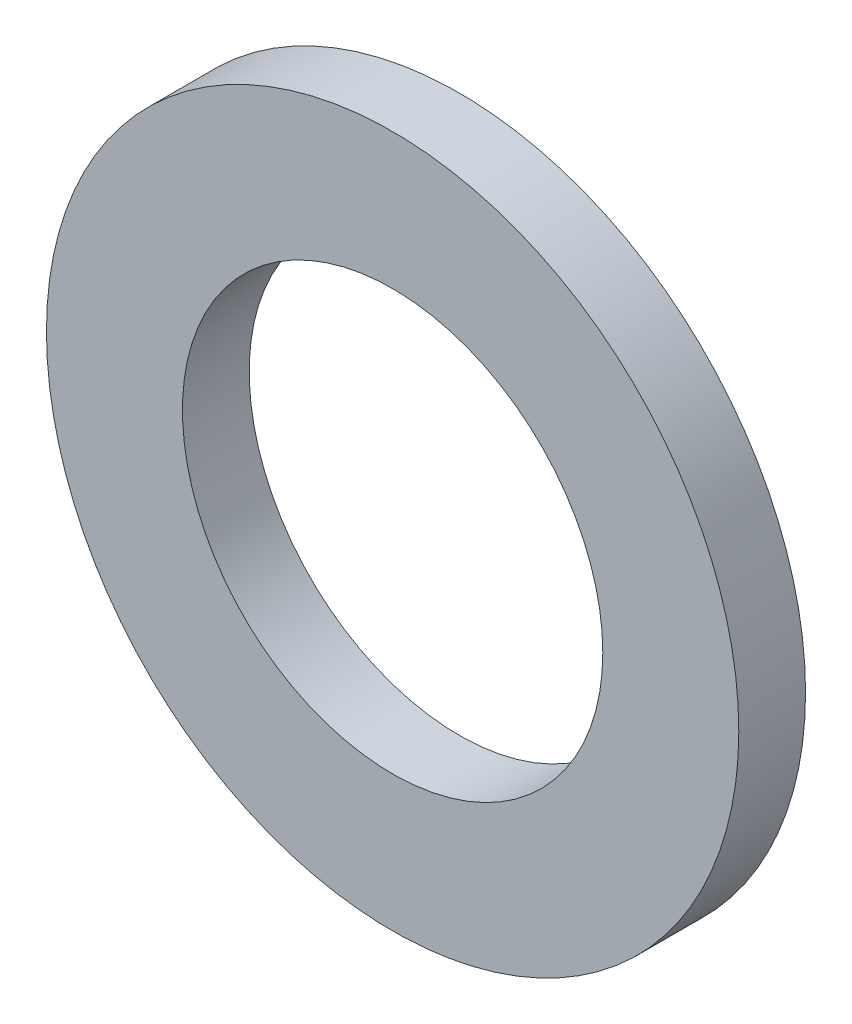
ISO-10303-21;
HEADER;
FILE_DESCRIPTION(('STEP AP214'),'2;1');
FILE_NAME('part.step','',(''),(''),'','','');
FILE_SCHEMA(('AUTOMOTIVE_DESIGN { 1 0 10303 214 1 1 1 1 }'));
ENDSEC;
DATA;
#1=APPLICATION_CONTEXT('core data for automotive mechanical design processes');
#2=APPLICATION_PROTOCOL_DEFINITION('international standard','automotive_design',2000,#1);
#3=PRODUCT_CONTEXT('',#1,'mechanical');
#4=PRODUCT('Part','Part','',(#3));
#5=PRODUCT_RELATED_PRODUCT_CATEGORY('part','',(#4));
#6=PRODUCT_DEFINITION_FORMATION('','',#4);
#7=PRODUCT_DEFINITION_CONTEXT('part definition',#1,'design');
#8=PRODUCT_DEFINITION('design','',#6,#7);
#9=PRODUCT_DEFINITION_SHAPE('','',#8);
#10=(LENGTH_UNIT() NAMED_UNIT(*) SI_UNIT(.MILLI.,.METRE.));
#11=(NAMED_UNIT(*) PLANE_ANGLE_UNIT() SI_UNIT($,.RADIAN.));
#12=(NAMED_UNIT(*) SI_UNIT($,.STERADIAN.) SOLID_ANGLE_UNIT());
#13=UNCERTAINTY_MEASURE_WITH_UNIT(LENGTH_MEASURE(1.E-05),#10,'distance_accuracy_value','');
#14=(GEOMETRIC_REPRESENTATION_CONTEXT(3) GLOBAL_UNCERTAINTY_ASSIGNED_CONTEXT((#13)) GLOBAL_UNIT_ASSIGNED_CONTEXT((#10,
#11,#12)) REPRESENTATION_CONTEXT('',''));
#15=CARTESIAN_POINT('',(0.,0.,0.));
#16=DIRECTION('',(0.,0.,1.));
#17=DIRECTION('',(1.,0.,0.));
#18=AXIS2_PLACEMENT_3D('',#15,#16,#17);
#19=CARTESIAN_POINT('',(0.,0.,2.7));
#20=DIRECTION('',(0.,0.,1.));
#21=DIRECTION('',(1.,0.,0.));
#22=AXIS2_PLACEMENT_3D('',#19,#20,#21);
#23=PLANE('',#22);
#24=CARTESIAN_POINT('',(0.,0.,2.7));
#25=DIRECTION('',(0.,0.,1.));
#26=DIRECTION('',(1.,0.,0.));
#27=AXIS2_PLACEMENT_3D('',#24,#25,#26);
#28=CIRCLE('',#27,14.);
#29=CARTESIAN_POINT('',(14.,0.,2.7));
#30=VERTEX_POINT('',#29);
#31=EDGE_CURVE('E10',#30,#30,#28,.T.);
#32=ORIENTED_EDGE('',*,*,#31,.T.);
#33=EDGE_LOOP('',(#32));
#34=FACE_BOUND('',#33,.T.);
#35=CARTESIAN_POINT('',(0.,0.,2.7));
#36=DIRECTION('',(0.,0.,1.));
#37=DIRECTION('',(1.,0.,0.));
#38=AXIS2_PLACEMENT_3D('',#35,#36,#37);
#39=CIRCLE('',#38,8.5);
#40=CARTESIAN_POINT('',(8.5,0.,2.7));
#41=VERTEX_POINT('',#40);
#42=EDGE_CURVE('E39',#41,#41,#39,.T.);
#43=ORIENTED_EDGE('',*,*,#42,.F.);
#44=EDGE_LOOP('',(#43));
#45=FACE_BOUND('',#44,.T.);
#46=ADVANCED_FACE('F28',(#34,#45),#23,.T.);
#47=CARTESIAN_POINT('',(0.,0.,0.));
#48=DIRECTION('',(0.,0.,1.));
#49=DIRECTION('',(1.,0.,0.));
#50=AXIS2_PLACEMENT_3D('',#47,#48,#49);
#51=PLANE('',#50);
#52=CARTESIAN_POINT('',(0.,0.,0.));
#53=DIRECTION('',(0.,0.,1.));
#54=DIRECTION('',(1.,0.,0.));
#55=AXIS2_PLACEMENT_3D('',#52,#53,#54);
#56=CIRCLE('',#55,14.);
#57=CARTESIAN_POINT('',(14.,0.,0.));
#58=VERTEX_POINT('',#57);
#59=EDGE_CURVE('E32',#58,#58,#56,.T.);
#60=ORIENTED_EDGE('',*,*,#59,.F.);
#61=EDGE_LOOP('',(#60));
#62=FACE_BOUND('',#61,.T.);
#63=CARTESIAN_POINT('',(0.,0.,0.));
#64=DIRECTION('',(0.,0.,1.));
#65=DIRECTION('',(1.,0.,0.));
#66=AXIS2_PLACEMENT_3D('',#63,#64,#65);
#67=CIRCLE('',#66,8.5);
#68=CARTESIAN_POINT('',(8.5,0.,0.));
#69=VERTEX_POINT('',#68);
#70=EDGE_CURVE('E41',#69,#69,#67,.T.);
#71=ORIENTED_EDGE('',*,*,#70,.T.);
#72=EDGE_LOOP('',(#71));
#73=FACE_BOUND('',#72,.T.);
#74=ADVANCED_FACE('F51',(#62,#73),#51,.F.);
#75=CARTESIAN_POINT('',(0.,0.,2.7));
#76=DIRECTION('',(0.,0.,-1.));
#77=DIRECTION('',(-1.,0.,0.));
#78=AXIS2_PLACEMENT_3D('',#75,#76,#77);
#79=CYLINDRICAL_SURFACE('',#78,14.);
#80=ORIENTED_EDGE('',*,*,#31,.F.);
#81=EDGE_LOOP('',(#80));
#82=FACE_BOUND('',#81,.T.);
#83=ORIENTED_EDGE('',*,*,#59,.T.);
#84=EDGE_LOOP('',(#83));
#85=FACE_BOUND('',#84,.T.);
#86=ADVANCED_FACE('F30',(#82,#85),#79,.T.);
#87=CARTESIAN_POINT('',(0.,0.,2.7));
#88=DIRECTION('',(0.,0.,-1.));
#89=DIRECTION('',(-1.,0.,0.));
#90=AXIS2_PLACEMENT_3D('',#87,#88,#89);
#91=CYLINDRICAL_SURFACE('',#90,8.5);
#92=ORIENTED_EDGE('',*,*,#42,.T.);
#93=EDGE_LOOP('',(#92));
#94=FACE_BOUND('',#93,.T.);
#95=ORIENTED_EDGE('',*,*,#70,.F.);
#96=EDGE_LOOP('',(#95));
#97=FACE_BOUND('',#96,.T.);
#98=ADVANCED_FACE('F47',(#94,#97),#91,.F.);
#99=CLOSED_SHELL('',(#46,#74,#86,#98));
#100=MANIFOLD_SOLID_BREP('B2',#99);
#101=ADVANCED_BREP_SHAPE_REPRESENTATION('',(#18,#100),#14);
#102=SHAPE_DEFINITION_REPRESENTATION(#9,#101);
ENDSEC;
END-ISO-10303-21;
